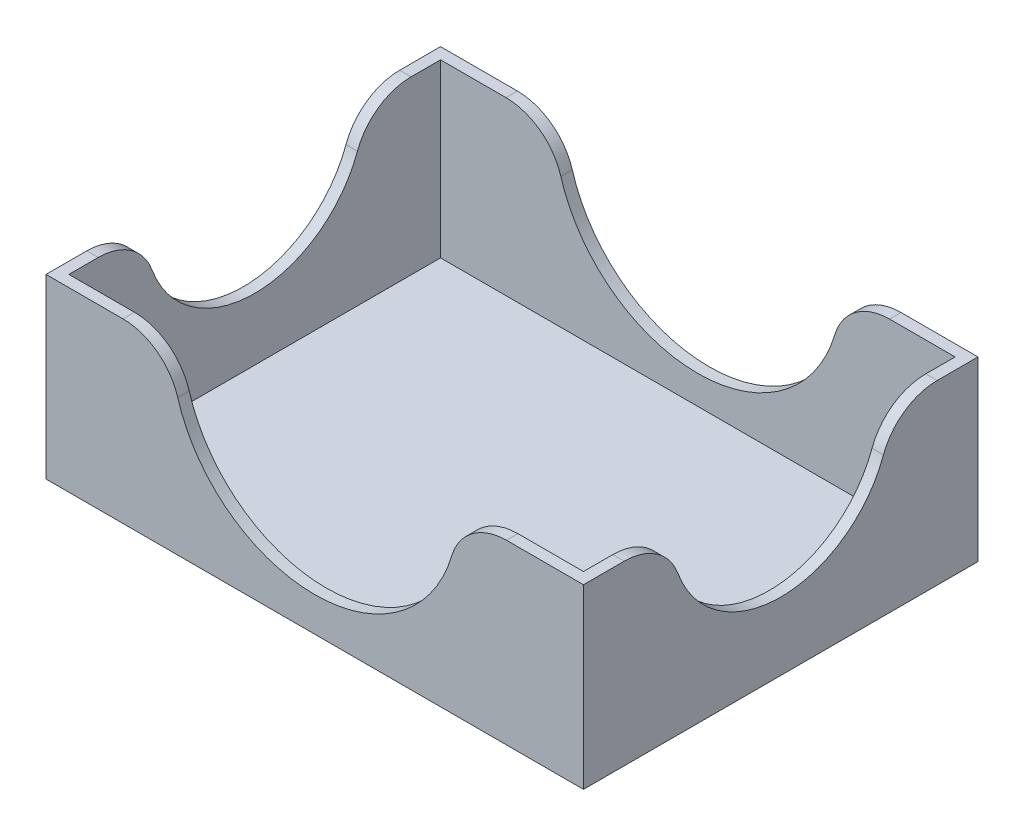
ISO-10303-21;
HEADER;
FILE_DESCRIPTION(('STEP AP214'),'2;1');
FILE_NAME('part.step','',(''),(''),'','','');
FILE_SCHEMA(('AUTOMOTIVE_DESIGN { 1 0 10303 214 1 1 1 1 }'));
ENDSEC;
DATA;
#1=APPLICATION_CONTEXT('core data for automotive mechanical design processes');
#2=APPLICATION_PROTOCOL_DEFINITION('international standard','automotive_design',2000,#1);
#3=PRODUCT_CONTEXT('',#1,'mechanical');
#4=PRODUCT('Part','Part','',(#3));
#5=PRODUCT_RELATED_PRODUCT_CATEGORY('part','',(#4));
#6=PRODUCT_DEFINITION_FORMATION('','',#4);
#7=PRODUCT_DEFINITION_CONTEXT('part definition',#1,'design');
#8=PRODUCT_DEFINITION('design','',#6,#7);
#9=PRODUCT_DEFINITION_SHAPE('','',#8);
#10=(LENGTH_UNIT() NAMED_UNIT(*) SI_UNIT(.MILLI.,.METRE.));
#11=(NAMED_UNIT(*) PLANE_ANGLE_UNIT() SI_UNIT($,.RADIAN.));
#12=(NAMED_UNIT(*) SI_UNIT($,.STERADIAN.) SOLID_ANGLE_UNIT());
#13=UNCERTAINTY_MEASURE_WITH_UNIT(LENGTH_MEASURE(1.E-05),#10,'distance_accuracy_value','');
#14=(GEOMETRIC_REPRESENTATION_CONTEXT(3) GLOBAL_UNCERTAINTY_ASSIGNED_CONTEXT((#13)) GLOBAL_UNIT_ASSIGNED_CONTEXT((#10,
#11,#12)) REPRESENTATION_CONTEXT('',''));
#15=CARTESIAN_POINT('',(0.,0.,0.));
#16=DIRECTION('',(0.,0.,1.));
#17=DIRECTION('',(1.,0.,0.));
#18=AXIS2_PLACEMENT_3D('',#15,#16,#17);
#19=CARTESIAN_POINT('',(0.,30.,0.));
#20=DIRECTION('',(0.,1.,0.));
#21=DIRECTION('',(0.,0.,1.));
#22=AXIS2_PLACEMENT_3D('',#19,#20,#21);
#23=PLANE('',#22);
#24=DIRECTION('',(1.,0.,0.));
#25=VECTOR('',#24,1.);
#26=CARTESIAN_POINT('',(-45.,30.,37.1259842519685));
#27=LINE('',#26,#25);
#28=CARTESIAN_POINT('',(33.5410196624968,30.,37.1259842519685));
#29=VERTEX_POINT('',#28);
#30=CARTESIAN_POINT('',(45.,30.,37.1259842519685));
#31=VERTEX_POINT('',#30);
#32=EDGE_CURVE('E237',#29,#31,#27,.T.);
#33=ORIENTED_EDGE('',*,*,#32,.F.);
#34=DIRECTION('',(0.,0.,1.));
#35=VECTOR('',#34,1.);
#36=CARTESIAN_POINT('',(33.5410196624968,30.,39.1259842519685));
#37=LINE('',#36,#35);
#38=CARTESIAN_POINT('',(33.5410196624968,30.,39.1259842519685));
#39=VERTEX_POINT('',#38);
#40=EDGE_CURVE('E345',#29,#39,#37,.T.);
#41=ORIENTED_EDGE('',*,*,#40,.T.);
#42=DIRECTION('',(1.,0.,0.));
#43=VECTOR('',#42,1.);
#44=CARTESIAN_POINT('',(-47.,30.,39.1259842519685));
#45=LINE('',#44,#43);
#46=CARTESIAN_POINT('',(47.,30.,39.1259842519685));
#47=VERTEX_POINT('',#46);
#48=EDGE_CURVE('E272',#39,#47,#45,.T.);
#49=ORIENTED_EDGE('',*,*,#48,.T.);
#50=DIRECTION('',(0.,0.,-1.));
#51=VECTOR('',#50,1.);
#52=CARTESIAN_POINT('',(47.,30.,-29.8740157480315));
#53=LINE('',#52,#51);
#54=CARTESIAN_POINT('',(47.,30.,31.985675570851));
#55=VERTEX_POINT('',#54);
#56=EDGE_CURVE('E277',#47,#55,#53,.T.);
#57=ORIENTED_EDGE('',*,*,#56,.T.);
#58=DIRECTION('',(-1.,0.,0.));
#59=VECTOR('',#58,1.);
#60=CARTESIAN_POINT('',(45.,30.,31.985675570851));
#61=LINE('',#60,#59);
#62=CARTESIAN_POINT('',(45.,30.,31.9856755708511));
#63=VERTEX_POINT('',#62);
#64=EDGE_CURVE('E308',#55,#63,#61,.T.);
#65=ORIENTED_EDGE('',*,*,#64,.T.);
#66=DIRECTION('',(0.,0.,-1.));
#67=VECTOR('',#66,1.);
#68=CARTESIAN_POINT('',(45.,30.,-27.8740157480315));
#69=LINE('',#68,#67);
#70=EDGE_CURVE('E243',#31,#63,#69,.T.);
#71=ORIENTED_EDGE('',*,*,#70,.F.);
#72=EDGE_LOOP('',(#33,#41,#49,#57,#65,#71));
#73=FACE_BOUND('',#72,.T.);
#74=ADVANCED_FACE('F36',(#73),#23,.T.);
#75=DIRECTION('',(-1.,0.,0.));
#76=VECTOR('',#75,1.);
#77=CARTESIAN_POINT('',(-47.,30.,-29.8740157480315));
#78=LINE('',#77,#76);
#79=CARTESIAN_POINT('',(47.,30.,-29.8740157480315));
#80=VERTEX_POINT('',#79);
#81=CARTESIAN_POINT('',(33.5410196624968,30.,-29.8740157480315));
#82=VERTEX_POINT('',#81);
#83=EDGE_CURVE('E209',#80,#82,#78,.T.);
#84=ORIENTED_EDGE('',*,*,#83,.T.);
#85=DIRECTION('',(0.,0.,1.));
#86=VECTOR('',#85,1.);
#87=CARTESIAN_POINT('',(33.5410196624968,30.,-27.8740157480315));
#88=LINE('',#87,#86);
#89=CARTESIAN_POINT('',(33.5410196624968,30.,-27.8740157480315));
#90=VERTEX_POINT('',#89);
#91=EDGE_CURVE('E11',#82,#90,#88,.T.);
#92=ORIENTED_EDGE('',*,*,#91,.T.);
#93=DIRECTION('',(-1.,0.,0.));
#94=VECTOR('',#93,1.);
#95=CARTESIAN_POINT('',(-45.,30.,-27.8740157480315));
#96=LINE('',#95,#94);
#97=CARTESIAN_POINT('',(45.,30.,-27.8740157480315));
#98=VERTEX_POINT('',#97);
#99=EDGE_CURVE('E247',#98,#90,#96,.T.);
#100=ORIENTED_EDGE('',*,*,#99,.F.);
#101=CARTESIAN_POINT('',(45.,30.,-22.7337070669141));
#102=VERTEX_POINT('',#101);
#103=EDGE_CURVE('E242',#102,#98,#69,.T.);
#104=ORIENTED_EDGE('',*,*,#103,.F.);
#105=DIRECTION('',(-1.,0.,0.));
#106=VECTOR('',#105,1.);
#107=CARTESIAN_POINT('',(47.,30.,-22.7337070669141));
#108=LINE('',#107,#106);
#109=CARTESIAN_POINT('',(47.,30.,-22.7337070669141));
#110=VERTEX_POINT('',#109);
#111=EDGE_CURVE('E300',#102,#110,#108,.F.);
#112=ORIENTED_EDGE('',*,*,#111,.T.);
#113=EDGE_CURVE('E276',#110,#80,#53,.T.);
#114=ORIENTED_EDGE('',*,*,#113,.T.);
#115=EDGE_LOOP('',(#84,#92,#100,#104,#112,#114));
#116=FACE_BOUND('',#115,.T.);
#117=ADVANCED_FACE('F443',(#116),#23,.T.);
#118=CARTESIAN_POINT('',(-47.,30.,39.1259842519685));
#119=VERTEX_POINT('',#118);
#120=CARTESIAN_POINT('',(-33.5410196624969,30.,39.1259842519685));
#121=VERTEX_POINT('',#120);
#122=EDGE_CURVE('E273',#119,#121,#45,.T.);
#123=ORIENTED_EDGE('',*,*,#122,.T.);
#124=DIRECTION('',(0.,0.,1.));
#125=VECTOR('',#124,1.);
#126=CARTESIAN_POINT('',(-33.5410196624969,30.,37.1259842519685));
#127=LINE('',#126,#125);
#128=CARTESIAN_POINT('',(-33.5410196624969,30.,37.1259842519685));
#129=VERTEX_POINT('',#128);
#130=EDGE_CURVE('E339',#121,#129,#127,.F.);
#131=ORIENTED_EDGE('',*,*,#130,.T.);
#132=CARTESIAN_POINT('',(-45.,30.,37.1259842519685));
#133=VERTEX_POINT('',#132);
#134=EDGE_CURVE('E239',#133,#129,#27,.T.);
#135=ORIENTED_EDGE('',*,*,#134,.F.);
#136=DIRECTION('',(0.,0.,1.));
#137=VECTOR('',#136,1.);
#138=CARTESIAN_POINT('',(-45.,30.,-27.8740157480315));
#139=LINE('',#138,#137);
#140=CARTESIAN_POINT('',(-45.,30.,31.985675570851));
#141=VERTEX_POINT('',#140);
#142=EDGE_CURVE('E238',#141,#133,#139,.T.);
#143=ORIENTED_EDGE('',*,*,#142,.F.);
#144=DIRECTION('',(-1.,0.,0.));
#145=VECTOR('',#144,1.);
#146=CARTESIAN_POINT('',(-47.,30.,31.985675570851));
#147=LINE('',#146,#145);
#148=CARTESIAN_POINT('',(-47.,30.,31.985675570851));
#149=VERTEX_POINT('',#148);
#150=EDGE_CURVE('E310',#141,#149,#147,.T.);
#151=ORIENTED_EDGE('',*,*,#150,.T.);
#152=DIRECTION('',(0.,0.,1.));
#153=VECTOR('',#152,1.);
#154=CARTESIAN_POINT('',(-47.,30.,-29.8740157480315));
#155=LINE('',#154,#153);
#156=EDGE_CURVE('E270',#149,#119,#155,.T.);
#157=ORIENTED_EDGE('',*,*,#156,.T.);
#158=EDGE_LOOP('',(#123,#131,#135,#143,#151,#157));
#159=FACE_BOUND('',#158,.T.);
#160=ADVANCED_FACE('F457',(#159),#23,.T.);
#161=CARTESIAN_POINT('',(-33.5410196624969,30.,-27.8740157480315));
#162=VERTEX_POINT('',#161);
#163=CARTESIAN_POINT('',(-45.,30.,-27.8740157480315));
#164=VERTEX_POINT('',#163);
#165=EDGE_CURVE('E246',#162,#164,#96,.T.);
#166=ORIENTED_EDGE('',*,*,#165,.F.);
#167=DIRECTION('',(0.,0.,1.));
#168=VECTOR('',#167,1.);
#169=CARTESIAN_POINT('',(-33.5410196624969,30.,-29.8740157480315));
#170=LINE('',#169,#168);
#171=CARTESIAN_POINT('',(-33.5410196624969,30.,-29.8740157480315));
#172=VERTEX_POINT('',#171);
#173=EDGE_CURVE('E59',#162,#172,#170,.F.);
#174=ORIENTED_EDGE('',*,*,#173,.T.);
#175=CARTESIAN_POINT('',(-47.,30.,-29.8740157480315));
#176=VERTEX_POINT('',#175);
#177=EDGE_CURVE('E280',#172,#176,#78,.T.);
#178=ORIENTED_EDGE('',*,*,#177,.T.);
#179=CARTESIAN_POINT('',(-47.,30.,-22.7337070669141));
#180=VERTEX_POINT('',#179);
#181=EDGE_CURVE('E207',#176,#180,#155,.T.);
#182=ORIENTED_EDGE('',*,*,#181,.T.);
#183=DIRECTION('',(-1.,0.,0.));
#184=VECTOR('',#183,1.);
#185=CARTESIAN_POINT('',(-45.,30.,-22.7337070669141));
#186=LINE('',#185,#184);
#187=CARTESIAN_POINT('',(-45.,30.,-22.7337070669141));
#188=VERTEX_POINT('',#187);
#189=EDGE_CURVE('E302',#180,#188,#186,.F.);
#190=ORIENTED_EDGE('',*,*,#189,.T.);
#191=EDGE_CURVE('E234',#164,#188,#139,.T.);
#192=ORIENTED_EDGE('',*,*,#191,.F.);
#193=EDGE_LOOP('',(#166,#174,#178,#182,#190,#192));
#194=FACE_BOUND('',#193,.T.);
#195=ADVANCED_FACE('F374',(#194),#23,.T.);
#196=CARTESIAN_POINT('',(-47.,30.,-29.8740157480315));
#197=DIRECTION('',(1.,0.,0.));
#198=DIRECTION('',(0.,0.,-1.));
#199=AXIS2_PLACEMENT_3D('',#196,#197,#198);
#200=PLANE('',#199);
#201=CARTESIAN_POINT('',(-47.,30.,4.62598425196846));
#202=DIRECTION('',(1.,0.,0.));
#203=DIRECTION('',(0.,0.,-1.));
#204=AXIS2_PLACEMENT_3D('',#201,#202,#203);
#205=CIRCLE('',#204,19.1299280648706);
#206=CARTESIAN_POINT('',(-47.,23.4328955353857,22.5933793530388));
#207=VERTEX_POINT('',#206);
#208=CARTESIAN_POINT('',(-47.,23.4328955353857,-13.3414108491019));
#209=VERTEX_POINT('',#208);
#210=EDGE_CURVE('E387',#207,#209,#205,.T.);
#211=ORIENTED_EDGE('',*,*,#210,.T.);
#212=CARTESIAN_POINT('',(-47.,20.,-22.7337070669141));
#213=DIRECTION('',(1.,0.,0.));
#214=DIRECTION('',(0.,0.,-1.));
#215=AXIS2_PLACEMENT_3D('',#212,#213,#214);
#216=CIRCLE('',#215,10.);
#217=EDGE_CURVE('E298',#209,#180,#216,.F.);
#218=ORIENTED_EDGE('',*,*,#217,.T.);
#219=ORIENTED_EDGE('',*,*,#181,.F.);
#220=DIRECTION('',(0.,-1.,0.));
#221=VECTOR('',#220,1.);
#222=CARTESIAN_POINT('',(-47.,30.,-29.8740157480315));
#223=LINE('',#222,#221);
#224=CARTESIAN_POINT('',(-47.,-1.,-29.8740157480315));
#225=VERTEX_POINT('',#224);
#226=EDGE_CURVE('E199',#176,#225,#223,.T.);
#227=ORIENTED_EDGE('',*,*,#226,.T.);
#228=DIRECTION('',(0.,0.,-1.));
#229=VECTOR('',#228,1.);
#230=CARTESIAN_POINT('',(-47.,-1.,39.1259842519685));
#231=LINE('',#230,#229);
#232=CARTESIAN_POINT('',(-47.,-1.,39.1259842519685));
#233=VERTEX_POINT('',#232);
#234=EDGE_CURVE('E205',#233,#225,#231,.T.);
#235=ORIENTED_EDGE('',*,*,#234,.F.);
#236=DIRECTION('',(0.,-1.,0.));
#237=VECTOR('',#236,1.);
#238=CARTESIAN_POINT('',(-47.,30.,39.1259842519685));
#239=LINE('',#238,#237);
#240=EDGE_CURVE('E285',#119,#233,#239,.T.);
#241=ORIENTED_EDGE('',*,*,#240,.F.);
#242=ORIENTED_EDGE('',*,*,#156,.F.);
#243=CARTESIAN_POINT('',(-47.,20.,31.985675570851));
#244=DIRECTION('',(1.,0.,0.));
#245=DIRECTION('',(0.,0.,-1.));
#246=AXIS2_PLACEMENT_3D('',#243,#244,#245);
#247=CIRCLE('',#246,10.);
#248=EDGE_CURVE('E296',#149,#207,#247,.F.);
#249=ORIENTED_EDGE('',*,*,#248,.T.);
#250=EDGE_LOOP('',(#211,#218,#219,#227,#235,#241,#242,#249));
#251=FACE_BOUND('',#250,.T.);
#252=ADVANCED_FACE('F202',(#251),#200,.F.);
#253=CARTESIAN_POINT('',(-47.,30.,39.1259842519685));
#254=DIRECTION('',(0.,0.,-1.));
#255=DIRECTION('',(-1.,0.,0.));
#256=AXIS2_PLACEMENT_3D('',#253,#254,#255);
#257=PLANE('',#256);
#258=CARTESIAN_POINT('',(0.,30.,39.1259842519685));
#259=DIRECTION('',(0.,0.,-1.));
#260=DIRECTION('',(-1.,0.,0.));
#261=AXIS2_PLACEMENT_3D('',#258,#259,#260);
#262=CIRCLE('',#261,25.);
#263=CARTESIAN_POINT('',(23.9578711874977,22.8571428571429,39.1259842519685));
#264=VERTEX_POINT('',#263);
#265=CARTESIAN_POINT('',(-23.9578711874978,22.8571428571429,39.1259842519685));
#266=VERTEX_POINT('',#265);
#267=EDGE_CURVE('E367',#264,#266,#262,.T.);
#268=ORIENTED_EDGE('',*,*,#267,.T.);
#269=CARTESIAN_POINT('',(-33.5410196624969,20.,39.1259842519685));
#270=DIRECTION('',(0.,0.,-1.));
#271=DIRECTION('',(-1.,0.,0.));
#272=AXIS2_PLACEMENT_3D('',#269,#270,#271);
#273=CIRCLE('',#272,10.);
#274=EDGE_CURVE('E337',#266,#121,#273,.F.);
#275=ORIENTED_EDGE('',*,*,#274,.T.);
#276=ORIENTED_EDGE('',*,*,#122,.F.);
#277=ORIENTED_EDGE('',*,*,#240,.T.);
#278=DIRECTION('',(-1.,0.,0.));
#279=VECTOR('',#278,1.);
#280=CARTESIAN_POINT('',(-47.,-1.,39.1259842519685));
#281=LINE('',#280,#279);
#282=CARTESIAN_POINT('',(47.,-1.,39.1259842519685));
#283=VERTEX_POINT('',#282);
#284=EDGE_CURVE('E223',#283,#233,#281,.T.);
#285=ORIENTED_EDGE('',*,*,#284,.F.);
#286=DIRECTION('',(0.,-1.,0.));
#287=VECTOR('',#286,1.);
#288=CARTESIAN_POINT('',(47.,30.,39.1259842519685));
#289=LINE('',#288,#287);
#290=EDGE_CURVE('E283',#47,#283,#289,.T.);
#291=ORIENTED_EDGE('',*,*,#290,.F.);
#292=ORIENTED_EDGE('',*,*,#48,.F.);
#293=CARTESIAN_POINT('',(33.5410196624968,20.,39.1259842519685));
#294=DIRECTION('',(0.,0.,-1.));
#295=DIRECTION('',(-1.,0.,0.));
#296=AXIS2_PLACEMENT_3D('',#293,#294,#295);
#297=CIRCLE('',#296,10.);
#298=EDGE_CURVE('E335',#39,#264,#297,.F.);
#299=ORIENTED_EDGE('',*,*,#298,.T.);
#300=EDGE_LOOP('',(#268,#275,#276,#277,#285,#291,#292,#299));
#301=FACE_BOUND('',#300,.T.);
#302=ADVANCED_FACE('F400',(#301),#257,.F.);
#303=CARTESIAN_POINT('',(47.,30.,-29.8740157480315));
#304=DIRECTION('',(-1.,0.,0.));
#305=DIRECTION('',(0.,0.,1.));
#306=AXIS2_PLACEMENT_3D('',#303,#304,#305);
#307=PLANE('',#306);
#308=ORIENTED_EDGE('',*,*,#113,.F.);
#309=CARTESIAN_POINT('',(47.,20.,-22.7337070669141));
#310=DIRECTION('',(-1.,0.,0.));
#311=DIRECTION('',(0.,0.,1.));
#312=AXIS2_PLACEMENT_3D('',#309,#310,#311);
#313=CIRCLE('',#312,10.);
#314=CARTESIAN_POINT('',(47.,23.4328955353857,-13.3414108491019));
#315=VERTEX_POINT('',#314);
#316=EDGE_CURVE('E324',#110,#315,#313,.F.);
#317=ORIENTED_EDGE('',*,*,#316,.T.);
#318=CARTESIAN_POINT('',(47.,30.,4.62598425196848));
#319=DIRECTION('',(-1.,0.,0.));
#320=DIRECTION('',(0.,0.,1.));
#321=AXIS2_PLACEMENT_3D('',#318,#319,#320);
#322=CIRCLE('',#321,19.1299280648706);
#323=CARTESIAN_POINT('',(47.,23.4328955353857,22.5933793530389));
#324=VERTEX_POINT('',#323);
#325=EDGE_CURVE('E227',#315,#324,#322,.T.);
#326=ORIENTED_EDGE('',*,*,#325,.T.);
#327=CARTESIAN_POINT('',(47.,20.,31.985675570851));
#328=DIRECTION('',(-1.,0.,0.));
#329=DIRECTION('',(0.,0.,1.));
#330=AXIS2_PLACEMENT_3D('',#327,#328,#329);
#331=CIRCLE('',#330,10.);
#332=EDGE_CURVE('E322',#324,#55,#331,.F.);
#333=ORIENTED_EDGE('',*,*,#332,.T.);
#334=ORIENTED_EDGE('',*,*,#56,.F.);
#335=ORIENTED_EDGE('',*,*,#290,.T.);
#336=DIRECTION('',(0.,0.,1.));
#337=VECTOR('',#336,1.);
#338=CARTESIAN_POINT('',(47.,-1.,39.1259842519685));
#339=LINE('',#338,#337);
#340=CARTESIAN_POINT('',(47.,-1.,-29.8740157480315));
#341=VERTEX_POINT('',#340);
#342=EDGE_CURVE('E218',#341,#283,#339,.T.);
#343=ORIENTED_EDGE('',*,*,#342,.F.);
#344=DIRECTION('',(0.,-1.,0.));
#345=VECTOR('',#344,1.);
#346=CARTESIAN_POINT('',(47.,30.,-29.8740157480315));
#347=LINE('',#346,#345);
#348=EDGE_CURVE('E208',#80,#341,#347,.T.);
#349=ORIENTED_EDGE('',*,*,#348,.F.);
#350=EDGE_LOOP('',(#308,#317,#326,#333,#334,#335,#343,#349));
#351=FACE_BOUND('',#350,.T.);
#352=ADVANCED_FACE('F433',(#351),#307,.F.);
#353=CARTESIAN_POINT('',(-47.,30.,-29.8740157480315));
#354=DIRECTION('',(0.,0.,1.));
#355=DIRECTION('',(1.,0.,0.));
#356=AXIS2_PLACEMENT_3D('',#353,#354,#355);
#357=PLANE('',#356);
#358=ORIENTED_EDGE('',*,*,#177,.F.);
#359=CARTESIAN_POINT('',(-33.5410196624969,20.,-29.8740157480315));
#360=DIRECTION('',(0.,0.,1.));
#361=DIRECTION('',(1.,0.,0.));
#362=AXIS2_PLACEMENT_3D('',#359,#360,#361);
#363=CIRCLE('',#362,10.);
#364=CARTESIAN_POINT('',(-23.9578711874978,22.8571428571429,-29.8740157480315));
#365=VERTEX_POINT('',#364);
#366=EDGE_CURVE('E44',#172,#365,#363,.F.);
#367=ORIENTED_EDGE('',*,*,#366,.T.);
#368=CARTESIAN_POINT('',(0.,30.,-29.8740157480315));
#369=DIRECTION('',(0.,0.,-1.));
#370=DIRECTION('',(-1.,0.,0.));
#371=AXIS2_PLACEMENT_3D('',#368,#369,#370);
#372=CIRCLE('',#371,25.);
#373=CARTESIAN_POINT('',(23.9578711874977,22.8571428571429,-29.8740157480315));
#374=VERTEX_POINT('',#373);
#375=EDGE_CURVE('E360',#374,#365,#372,.T.);
#376=ORIENTED_EDGE('',*,*,#375,.F.);
#377=CARTESIAN_POINT('',(33.5410196624968,20.,-29.8740157480315));
#378=DIRECTION('',(0.,0.,1.));
#379=DIRECTION('',(1.,0.,0.));
#380=AXIS2_PLACEMENT_3D('',#377,#378,#379);
#381=CIRCLE('',#380,10.);
#382=EDGE_CURVE('E51',#374,#82,#381,.F.);
#383=ORIENTED_EDGE('',*,*,#382,.T.);
#384=ORIENTED_EDGE('',*,*,#83,.F.);
#385=ORIENTED_EDGE('',*,*,#348,.T.);
#386=DIRECTION('',(1.,0.,0.));
#387=VECTOR('',#386,1.);
#388=CARTESIAN_POINT('',(-47.,-1.,-29.8740157480315));
#389=LINE('',#388,#387);
#390=EDGE_CURVE('E212',#225,#341,#389,.T.);
#391=ORIENTED_EDGE('',*,*,#390,.F.);
#392=ORIENTED_EDGE('',*,*,#226,.F.);
#393=EDGE_LOOP('',(#358,#367,#376,#383,#384,#385,#391,#392));
#394=FACE_BOUND('',#393,.T.);
#395=ADVANCED_FACE('F213',(#394),#357,.F.);
#396=CARTESIAN_POINT('',(-45.,30.,-27.8740157480315));
#397=DIRECTION('',(1.,0.,0.));
#398=DIRECTION('',(0.,0.,-1.));
#399=AXIS2_PLACEMENT_3D('',#396,#397,#398);
#400=PLANE('',#399);
#401=ORIENTED_EDGE('',*,*,#191,.T.);
#402=CARTESIAN_POINT('',(-45.,20.,-22.7337070669141));
#403=DIRECTION('',(1.,0.,0.));
#404=DIRECTION('',(0.,0.,-1.));
#405=AXIS2_PLACEMENT_3D('',#402,#403,#404);
#406=CIRCLE('',#405,10.);
#407=CARTESIAN_POINT('',(-45.,23.4328955353857,-13.3414108491019));
#408=VERTEX_POINT('',#407);
#409=EDGE_CURVE('E306',#188,#408,#406,.T.);
#410=ORIENTED_EDGE('',*,*,#409,.T.);
#411=CARTESIAN_POINT('',(-45.,30.,4.62598425196846));
#412=DIRECTION('',(1.,0.,0.));
#413=DIRECTION('',(0.,0.,-1.));
#414=AXIS2_PLACEMENT_3D('',#411,#412,#413);
#415=CIRCLE('',#414,19.1299280648706);
#416=CARTESIAN_POINT('',(-45.,23.4328955353857,22.5933793530388));
#417=VERTEX_POINT('',#416);
#418=EDGE_CURVE('E224',#417,#408,#415,.T.);
#419=ORIENTED_EDGE('',*,*,#418,.F.);
#420=CARTESIAN_POINT('',(-45.,20.,31.985675570851));
#421=DIRECTION('',(1.,0.,0.));
#422=DIRECTION('',(0.,0.,-1.));
#423=AXIS2_PLACEMENT_3D('',#420,#421,#422);
#424=CIRCLE('',#423,10.);
#425=EDGE_CURVE('E304',#417,#141,#424,.T.);
#426=ORIENTED_EDGE('',*,*,#425,.T.);
#427=ORIENTED_EDGE('',*,*,#142,.T.);
#428=DIRECTION('',(0.,-1.,0.));
#429=VECTOR('',#428,1.);
#430=CARTESIAN_POINT('',(-45.,30.,37.1259842519685));
#431=LINE('',#430,#429);
#432=CARTESIAN_POINT('',(-45.,0.,37.1259842519685));
#433=VERTEX_POINT('',#432);
#434=EDGE_CURVE('E267',#133,#433,#431,.T.);
#435=ORIENTED_EDGE('',*,*,#434,.T.);
#436=DIRECTION('',(0.,0.,1.));
#437=VECTOR('',#436,1.);
#438=CARTESIAN_POINT('',(-45.,0.,-27.8740157480315));
#439=LINE('',#438,#437);
#440=CARTESIAN_POINT('',(-45.,0.,-27.8740157480315));
#441=VERTEX_POINT('',#440);
#442=EDGE_CURVE('E233',#441,#433,#439,.T.);
#443=ORIENTED_EDGE('',*,*,#442,.F.);
#444=DIRECTION('',(0.,-1.,0.));
#445=VECTOR('',#444,1.);
#446=CARTESIAN_POINT('',(-45.,30.,-27.8740157480315));
#447=LINE('',#446,#445);
#448=EDGE_CURVE('E250',#164,#441,#447,.T.);
#449=ORIENTED_EDGE('',*,*,#448,.F.);
#450=EDGE_LOOP('',(#401,#410,#419,#426,#427,#435,#443,#449));
#451=FACE_BOUND('',#450,.T.);
#452=ADVANCED_FACE('F378',(#451),#400,.T.);
#453=CARTESIAN_POINT('',(-45.,30.,37.1259842519685));
#454=DIRECTION('',(0.,0.,-1.));
#455=DIRECTION('',(-1.,0.,0.));
#456=AXIS2_PLACEMENT_3D('',#453,#454,#455);
#457=PLANE('',#456);
#458=ORIENTED_EDGE('',*,*,#134,.T.);
#459=CARTESIAN_POINT('',(-33.5410196624969,20.,37.1259842519685));
#460=DIRECTION('',(0.,0.,-1.));
#461=DIRECTION('',(-1.,0.,0.));
#462=AXIS2_PLACEMENT_3D('',#459,#460,#461);
#463=CIRCLE('',#462,10.);
#464=CARTESIAN_POINT('',(-23.9578711874978,22.8571428571429,37.1259842519685));
#465=VERTEX_POINT('',#464);
#466=EDGE_CURVE('E343',#129,#465,#463,.T.);
#467=ORIENTED_EDGE('',*,*,#466,.T.);
#468=CARTESIAN_POINT('',(0.,30.,37.1259842519685));
#469=DIRECTION('',(0.,0.,-1.));
#470=DIRECTION('',(-1.,0.,0.));
#471=AXIS2_PLACEMENT_3D('',#468,#469,#470);
#472=CIRCLE('',#471,25.);
#473=CARTESIAN_POINT('',(23.9578711874977,22.8571428571429,37.1259842519685));
#474=VERTEX_POINT('',#473);
#475=EDGE_CURVE('E391',#474,#465,#472,.T.);
#476=ORIENTED_EDGE('',*,*,#475,.F.);
#477=CARTESIAN_POINT('',(33.5410196624968,20.,37.1259842519685));
#478=DIRECTION('',(0.,0.,-1.));
#479=DIRECTION('',(-1.,0.,0.));
#480=AXIS2_PLACEMENT_3D('',#477,#478,#479);
#481=CIRCLE('',#480,10.);
#482=EDGE_CURVE('E341',#474,#29,#481,.T.);
#483=ORIENTED_EDGE('',*,*,#482,.T.);
#484=ORIENTED_EDGE('',*,*,#32,.T.);
#485=DIRECTION('',(0.,-1.,0.));
#486=VECTOR('',#485,1.);
#487=CARTESIAN_POINT('',(45.,30.,37.1259842519685));
#488=LINE('',#487,#486);
#489=CARTESIAN_POINT('',(45.,0.,37.1259842519685));
#490=VERTEX_POINT('',#489);
#491=EDGE_CURVE('E265',#31,#490,#488,.T.);
#492=ORIENTED_EDGE('',*,*,#491,.T.);
#493=DIRECTION('',(1.,0.,0.));
#494=VECTOR('',#493,1.);
#495=CARTESIAN_POINT('',(-45.,0.,37.1259842519685));
#496=LINE('',#495,#494);
#497=EDGE_CURVE('E253',#433,#490,#496,.T.);
#498=ORIENTED_EDGE('',*,*,#497,.F.);
#499=ORIENTED_EDGE('',*,*,#434,.F.);
#500=EDGE_LOOP('',(#458,#467,#476,#483,#484,#492,#498,#499));
#501=FACE_BOUND('',#500,.T.);
#502=ADVANCED_FACE('F414',(#501),#457,.T.);
#503=CARTESIAN_POINT('',(45.,30.,-27.8740157480315));
#504=DIRECTION('',(-1.,0.,0.));
#505=DIRECTION('',(0.,0.,1.));
#506=AXIS2_PLACEMENT_3D('',#503,#504,#505);
#507=PLANE('',#506);
#508=CARTESIAN_POINT('',(45.,30.,4.62598425196848));
#509=DIRECTION('',(-1.,0.,0.));
#510=DIRECTION('',(0.,0.,1.));
#511=AXIS2_PLACEMENT_3D('',#508,#509,#510);
#512=CIRCLE('',#511,19.1299280648706);
#513=CARTESIAN_POINT('',(45.,23.4328955353857,-13.3414108491019));
#514=VERTEX_POINT('',#513);
#515=CARTESIAN_POINT('',(45.,23.4328955353857,22.5933793530389));
#516=VERTEX_POINT('',#515);
#517=EDGE_CURVE('E287',#514,#516,#512,.T.);
#518=ORIENTED_EDGE('',*,*,#517,.F.);
#519=CARTESIAN_POINT('',(45.,20.,-22.7337070669141));
#520=DIRECTION('',(-1.,0.,0.));
#521=DIRECTION('',(0.,0.,1.));
#522=AXIS2_PLACEMENT_3D('',#519,#520,#521);
#523=CIRCLE('',#522,10.);
#524=EDGE_CURVE('E320',#514,#102,#523,.T.);
#525=ORIENTED_EDGE('',*,*,#524,.T.);
#526=ORIENTED_EDGE('',*,*,#103,.T.);
#527=DIRECTION('',(0.,-1.,0.));
#528=VECTOR('',#527,1.);
#529=CARTESIAN_POINT('',(45.,30.,-27.8740157480315));
#530=LINE('',#529,#528);
#531=CARTESIAN_POINT('',(45.,0.,-27.8740157480315));
#532=VERTEX_POINT('',#531);
#533=EDGE_CURVE('E263',#98,#532,#530,.T.);
#534=ORIENTED_EDGE('',*,*,#533,.T.);
#535=DIRECTION('',(0.,0.,-1.));
#536=VECTOR('',#535,1.);
#537=CARTESIAN_POINT('',(45.,0.,-27.8740157480315));
#538=LINE('',#537,#536);
#539=EDGE_CURVE('E256',#490,#532,#538,.T.);
#540=ORIENTED_EDGE('',*,*,#539,.F.);
#541=ORIENTED_EDGE('',*,*,#491,.F.);
#542=ORIENTED_EDGE('',*,*,#70,.T.);
#543=CARTESIAN_POINT('',(45.,20.,31.985675570851));
#544=DIRECTION('',(-1.,0.,0.));
#545=DIRECTION('',(0.,0.,1.));
#546=AXIS2_PLACEMENT_3D('',#543,#544,#545);
#547=CIRCLE('',#546,10.);
#548=EDGE_CURVE('E318',#63,#516,#547,.T.);
#549=ORIENTED_EDGE('',*,*,#548,.T.);
#550=EDGE_LOOP('',(#518,#525,#526,#534,#540,#541,#542,#549));
#551=FACE_BOUND('',#550,.T.);
#552=ADVANCED_FACE('F422',(#551),#507,.T.);
#553=CARTESIAN_POINT('',(-45.,30.,-27.8740157480315));
#554=DIRECTION('',(0.,0.,1.));
#555=DIRECTION('',(1.,0.,0.));
#556=AXIS2_PLACEMENT_3D('',#553,#554,#555);
#557=PLANE('',#556);
#558=CARTESIAN_POINT('',(0.,30.,-27.8740157480315));
#559=DIRECTION('',(0.,0.,1.));
#560=DIRECTION('',(1.,0.,0.));
#561=AXIS2_PLACEMENT_3D('',#558,#559,#560);
#562=CIRCLE('',#561,25.);
#563=CARTESIAN_POINT('',(-23.9578711874978,22.8571428571429,-27.8740157480315));
#564=VERTEX_POINT('',#563);
#565=CARTESIAN_POINT('',(23.9578711874977,22.8571428571429,-27.8740157480315));
#566=VERTEX_POINT('',#565);
#567=EDGE_CURVE('E326',#564,#566,#562,.T.);
#568=ORIENTED_EDGE('',*,*,#567,.F.);
#569=CARTESIAN_POINT('',(-33.5410196624969,20.,-27.8740157480315));
#570=DIRECTION('',(0.,0.,1.));
#571=DIRECTION('',(1.,0.,0.));
#572=AXIS2_PLACEMENT_3D('',#569,#570,#571);
#573=CIRCLE('',#572,10.);
#574=EDGE_CURVE('E355',#564,#162,#573,.T.);
#575=ORIENTED_EDGE('',*,*,#574,.T.);
#576=ORIENTED_EDGE('',*,*,#165,.T.);
#577=ORIENTED_EDGE('',*,*,#448,.T.);
#578=DIRECTION('',(-1.,0.,0.));
#579=VECTOR('',#578,1.);
#580=CARTESIAN_POINT('',(-45.,0.,-27.8740157480315));
#581=LINE('',#580,#579);
#582=EDGE_CURVE('E259',#532,#441,#581,.T.);
#583=ORIENTED_EDGE('',*,*,#582,.F.);
#584=ORIENTED_EDGE('',*,*,#533,.F.);
#585=ORIENTED_EDGE('',*,*,#99,.T.);
#586=CARTESIAN_POINT('',(33.5410196624968,20.,-27.8740157480315));
#587=DIRECTION('',(0.,0.,1.));
#588=DIRECTION('',(1.,0.,0.));
#589=AXIS2_PLACEMENT_3D('',#586,#587,#588);
#590=CIRCLE('',#589,10.);
#591=EDGE_CURVE('E353',#90,#566,#590,.T.);
#592=ORIENTED_EDGE('',*,*,#591,.T.);
#593=EDGE_LOOP('',(#568,#575,#576,#577,#583,#584,#585,#592));
#594=FACE_BOUND('',#593,.T.);
#595=ADVANCED_FACE('F371',(#594),#557,.T.);
#596=CARTESIAN_POINT('',(0.,0.,0.));
#597=DIRECTION('',(0.,-1.,0.));
#598=DIRECTION('',(0.,0.,-1.));
#599=AXIS2_PLACEMENT_3D('',#596,#597,#598);
#600=PLANE('',#599);
#601=ORIENTED_EDGE('',*,*,#582,.T.);
#602=ORIENTED_EDGE('',*,*,#442,.T.);
#603=ORIENTED_EDGE('',*,*,#497,.T.);
#604=ORIENTED_EDGE('',*,*,#539,.T.);
#605=EDGE_LOOP('',(#601,#602,#603,#604));
#606=FACE_BOUND('',#605,.T.);
#607=ADVANCED_FACE('F598',(#606),#600,.F.);
#608=CARTESIAN_POINT('',(0.,-1.,0.));
#609=DIRECTION('',(0.,-1.,0.));
#610=DIRECTION('',(0.,0.,-1.));
#611=AXIS2_PLACEMENT_3D('',#608,#609,#610);
#612=PLANE('',#611);
#613=ORIENTED_EDGE('',*,*,#234,.T.);
#614=ORIENTED_EDGE('',*,*,#390,.T.);
#615=ORIENTED_EDGE('',*,*,#342,.T.);
#616=ORIENTED_EDGE('',*,*,#284,.T.);
#617=EDGE_LOOP('',(#613,#614,#615,#616));
#618=FACE_BOUND('',#617,.T.);
#619=ADVANCED_FACE('F221',(#618),#612,.T.);
#620=CARTESIAN_POINT('',(-47.,30.,4.62598425196846));
#621=DIRECTION('',(1.,0.,0.));
#622=DIRECTION('',(0.,0.,-1.));
#623=AXIS2_PLACEMENT_3D('',#620,#621,#622);
#624=CYLINDRICAL_SURFACE('',#623,19.1299280648706);
#625=ORIENTED_EDGE('',*,*,#325,.F.);
#626=DIRECTION('',(1.,0.,0.));
#627=VECTOR('',#626,1.);
#628=CARTESIAN_POINT('',(-47.,23.4328955353857,-13.3414108491019));
#629=LINE('',#628,#627);
#630=EDGE_CURVE('E315',#315,#514,#629,.F.);
#631=ORIENTED_EDGE('',*,*,#630,.T.);
#632=ORIENTED_EDGE('',*,*,#517,.T.);
#633=DIRECTION('',(1.,0.,0.));
#634=VECTOR('',#633,1.);
#635=CARTESIAN_POINT('',(-47.,23.4328955353857,22.5933793530388));
#636=LINE('',#635,#634);
#637=EDGE_CURVE('E312',#516,#324,#636,.T.);
#638=ORIENTED_EDGE('',*,*,#637,.T.);
#639=EDGE_LOOP('',(#625,#631,#632,#638));
#640=FACE_BOUND('',#639,.T.);
#641=ADVANCED_FACE('F429',(#640),#624,.F.);
#642=ORIENTED_EDGE('',*,*,#418,.T.);
#643=DIRECTION('',(1.,0.,0.));
#644=VECTOR('',#643,1.);
#645=CARTESIAN_POINT('',(-47.,23.4328955353857,-13.3414108491019));
#646=LINE('',#645,#644);
#647=EDGE_CURVE('E293',#408,#209,#646,.F.);
#648=ORIENTED_EDGE('',*,*,#647,.T.);
#649=ORIENTED_EDGE('',*,*,#210,.F.);
#650=DIRECTION('',(1.,0.,0.));
#651=VECTOR('',#650,1.);
#652=CARTESIAN_POINT('',(-47.,23.4328955353857,22.5933793530388));
#653=LINE('',#652,#651);
#654=EDGE_CURVE('E290',#207,#417,#653,.T.);
#655=ORIENTED_EDGE('',*,*,#654,.T.);
#656=EDGE_LOOP('',(#642,#648,#649,#655));
#657=FACE_BOUND('',#656,.T.);
#658=ADVANCED_FACE('F386',(#657),#624,.F.);
#659=CARTESIAN_POINT('',(-47.,20.,-22.7337070669141));
#660=DIRECTION('',(1.,0.,0.));
#661=DIRECTION('',(0.,0.,-1.));
#662=AXIS2_PLACEMENT_3D('',#659,#660,#661);
#663=CYLINDRICAL_SURFACE('',#662,10.);
#664=ORIENTED_EDGE('',*,*,#409,.F.);
#665=ORIENTED_EDGE('',*,*,#189,.F.);
#666=ORIENTED_EDGE('',*,*,#217,.F.);
#667=ORIENTED_EDGE('',*,*,#647,.F.);
#668=EDGE_LOOP('',(#664,#665,#666,#667));
#669=FACE_BOUND('',#668,.T.);
#670=ADVANCED_FACE('F383',(#669),#663,.T.);
#671=CARTESIAN_POINT('',(-47.,20.,31.985675570851));
#672=DIRECTION('',(1.,0.,0.));
#673=DIRECTION('',(0.,0.,-1.));
#674=AXIS2_PLACEMENT_3D('',#671,#672,#673);
#675=CYLINDRICAL_SURFACE('',#674,10.);
#676=ORIENTED_EDGE('',*,*,#248,.F.);
#677=ORIENTED_EDGE('',*,*,#150,.F.);
#678=ORIENTED_EDGE('',*,*,#425,.F.);
#679=ORIENTED_EDGE('',*,*,#654,.F.);
#680=EDGE_LOOP('',(#676,#677,#678,#679));
#681=FACE_BOUND('',#680,.T.);
#682=ADVANCED_FACE('F478',(#681),#675,.T.);
#683=CARTESIAN_POINT('',(-47.,20.,-22.7337070669141));
#684=DIRECTION('',(1.,0.,0.));
#685=DIRECTION('',(0.,0.,-1.));
#686=AXIS2_PLACEMENT_3D('',#683,#684,#685);
#687=CYLINDRICAL_SURFACE('',#686,10.);
#688=ORIENTED_EDGE('',*,*,#316,.F.);
#689=ORIENTED_EDGE('',*,*,#111,.F.);
#690=ORIENTED_EDGE('',*,*,#524,.F.);
#691=ORIENTED_EDGE('',*,*,#630,.F.);
#692=EDGE_LOOP('',(#688,#689,#690,#691));
#693=FACE_BOUND('',#692,.T.);
#694=ADVANCED_FACE('F438',(#693),#687,.T.);
#695=CARTESIAN_POINT('',(-47.,20.,31.985675570851));
#696=DIRECTION('',(1.,0.,0.));
#697=DIRECTION('',(0.,0.,-1.));
#698=AXIS2_PLACEMENT_3D('',#695,#696,#697);
#699=CYLINDRICAL_SURFACE('',#698,10.);
#700=ORIENTED_EDGE('',*,*,#548,.F.);
#701=ORIENTED_EDGE('',*,*,#64,.F.);
#702=ORIENTED_EDGE('',*,*,#332,.F.);
#703=ORIENTED_EDGE('',*,*,#637,.F.);
#704=EDGE_LOOP('',(#700,#701,#702,#703));
#705=FACE_BOUND('',#704,.T.);
#706=ADVANCED_FACE('F426',(#705),#699,.T.);
#707=CARTESIAN_POINT('',(0.,30.,39.1259842519685));
#708=DIRECTION('',(0.,0.,-1.));
#709=DIRECTION('',(-1.,0.,0.));
#710=AXIS2_PLACEMENT_3D('',#707,#708,#709);
#711=CYLINDRICAL_SURFACE('',#710,25.);
#712=ORIENTED_EDGE('',*,*,#375,.T.);
#713=DIRECTION('',(0.,0.,-1.));
#714=VECTOR('',#713,1.);
#715=CARTESIAN_POINT('',(-23.9578711874978,22.8571428571429,39.1259842519685));
#716=LINE('',#715,#714);
#717=EDGE_CURVE('E350',#365,#564,#716,.F.);
#718=ORIENTED_EDGE('',*,*,#717,.T.);
#719=ORIENTED_EDGE('',*,*,#567,.T.);
#720=DIRECTION('',(0.,0.,-1.));
#721=VECTOR('',#720,1.);
#722=CARTESIAN_POINT('',(23.9578711874977,22.8571428571429,39.1259842519685));
#723=LINE('',#722,#721);
#724=EDGE_CURVE('E347',#566,#374,#723,.T.);
#725=ORIENTED_EDGE('',*,*,#724,.T.);
#726=EDGE_LOOP('',(#712,#718,#719,#725));
#727=FACE_BOUND('',#726,.T.);
#728=ADVANCED_FACE('F364',(#727),#711,.F.);
#729=ORIENTED_EDGE('',*,*,#475,.T.);
#730=DIRECTION('',(0.,0.,-1.));
#731=VECTOR('',#730,1.);
#732=CARTESIAN_POINT('',(-23.9578711874978,22.8571428571429,39.1259842519685));
#733=LINE('',#732,#731);
#734=EDGE_CURVE('E332',#465,#266,#733,.F.);
#735=ORIENTED_EDGE('',*,*,#734,.T.);
#736=ORIENTED_EDGE('',*,*,#267,.F.);
#737=DIRECTION('',(0.,0.,-1.));
#738=VECTOR('',#737,1.);
#739=CARTESIAN_POINT('',(23.9578711874977,22.8571428571429,39.1259842519685));
#740=LINE('',#739,#738);
#741=EDGE_CURVE('E329',#264,#474,#740,.T.);
#742=ORIENTED_EDGE('',*,*,#741,.T.);
#743=EDGE_LOOP('',(#729,#735,#736,#742));
#744=FACE_BOUND('',#743,.T.);
#745=ADVANCED_FACE('F406',(#744),#711,.F.);
#746=CARTESIAN_POINT('',(-33.5410196624969,20.,39.1259842519685));
#747=DIRECTION('',(0.,0.,-1.));
#748=DIRECTION('',(-1.,0.,0.));
#749=AXIS2_PLACEMENT_3D('',#746,#747,#748);
#750=CYLINDRICAL_SURFACE('',#749,10.);
#751=ORIENTED_EDGE('',*,*,#466,.F.);
#752=ORIENTED_EDGE('',*,*,#130,.F.);
#753=ORIENTED_EDGE('',*,*,#274,.F.);
#754=ORIENTED_EDGE('',*,*,#734,.F.);
#755=EDGE_LOOP('',(#751,#752,#753,#754));
#756=FACE_BOUND('',#755,.T.);
#757=ADVANCED_FACE('F473',(#756),#750,.T.);
#758=CARTESIAN_POINT('',(33.5410196624968,20.,39.1259842519685));
#759=DIRECTION('',(0.,0.,-1.));
#760=DIRECTION('',(-1.,0.,0.));
#761=AXIS2_PLACEMENT_3D('',#758,#759,#760);
#762=CYLINDRICAL_SURFACE('',#761,10.);
#763=ORIENTED_EDGE('',*,*,#298,.F.);
#764=ORIENTED_EDGE('',*,*,#40,.F.);
#765=ORIENTED_EDGE('',*,*,#482,.F.);
#766=ORIENTED_EDGE('',*,*,#741,.F.);
#767=EDGE_LOOP('',(#763,#764,#765,#766));
#768=FACE_BOUND('',#767,.T.);
#769=ADVANCED_FACE('F410',(#768),#762,.T.);
#770=CARTESIAN_POINT('',(-33.5410196624969,20.,39.1259842519685));
#771=DIRECTION('',(0.,0.,-1.));
#772=DIRECTION('',(-1.,0.,0.));
#773=AXIS2_PLACEMENT_3D('',#770,#771,#772);
#774=CYLINDRICAL_SURFACE('',#773,10.);
#775=ORIENTED_EDGE('',*,*,#366,.F.);
#776=ORIENTED_EDGE('',*,*,#173,.F.);
#777=ORIENTED_EDGE('',*,*,#574,.F.);
#778=ORIENTED_EDGE('',*,*,#717,.F.);
#779=EDGE_LOOP('',(#775,#776,#777,#778));
#780=FACE_BOUND('',#779,.T.);
#781=ADVANCED_FACE('F369',(#780),#774,.T.);
#782=CARTESIAN_POINT('',(33.5410196624968,20.,39.1259842519685));
#783=DIRECTION('',(0.,0.,-1.));
#784=DIRECTION('',(-1.,0.,0.));
#785=AXIS2_PLACEMENT_3D('',#782,#783,#784);
#786=CYLINDRICAL_SURFACE('',#785,10.);
#787=ORIENTED_EDGE('',*,*,#591,.F.);
#788=ORIENTED_EDGE('',*,*,#91,.F.);
#789=ORIENTED_EDGE('',*,*,#382,.F.);
#790=ORIENTED_EDGE('',*,*,#724,.F.);
#791=EDGE_LOOP('',(#787,#788,#789,#790));
#792=FACE_BOUND('',#791,.T.);
#793=ADVANCED_FACE('F38',(#792),#786,.T.);
#794=CLOSED_SHELL('',(#74,#117,#160,#195,#252,#302,#352,#395,#452,#502,#552,#595,#607,#619,#641,
#658,#670,#682,#694,#706,#728,#745,#757,#769,#781,#793));
#795=MANIFOLD_SOLID_BREP('B2',#794);
#796=ADVANCED_BREP_SHAPE_REPRESENTATION('',(#18,#795),#14);
#797=SHAPE_DEFINITION_REPRESENTATION(#9,#796);
ENDSEC;
END-ISO-10303-21;
